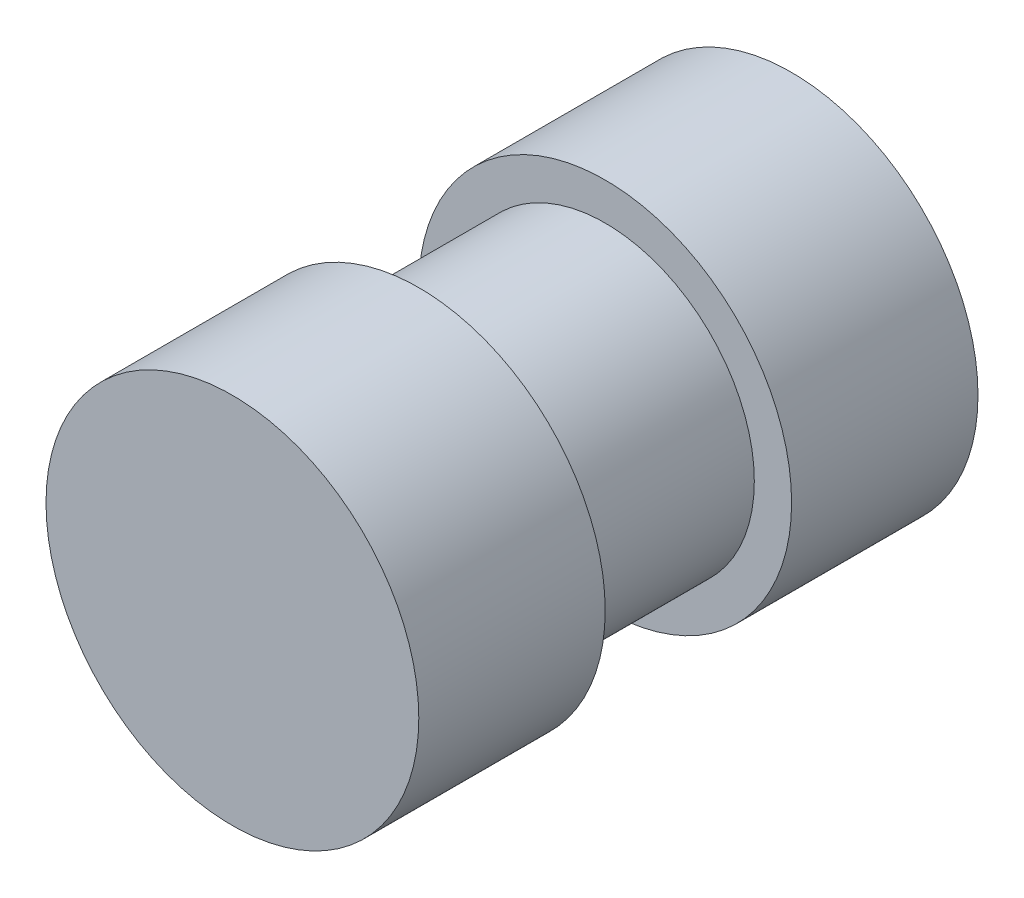
ISO-10303-21;
HEADER;
FILE_DESCRIPTION(('STEP AP214'),'2;1');
FILE_NAME('part.step','',(''),(''),'','','');
FILE_SCHEMA(('AUTOMOTIVE_DESIGN { 1 0 10303 214 1 1 1 1 }'));
ENDSEC;
DATA;
#1=APPLICATION_CONTEXT('core data for automotive mechanical design processes');
#2=APPLICATION_PROTOCOL_DEFINITION('international standard','automotive_design',2000,#1);
#3=PRODUCT_CONTEXT('',#1,'mechanical');
#4=PRODUCT('Part','Part','',(#3));
#5=PRODUCT_RELATED_PRODUCT_CATEGORY('part','',(#4));
#6=PRODUCT_DEFINITION_FORMATION('','',#4);
#7=PRODUCT_DEFINITION_CONTEXT('part definition',#1,'design');
#8=PRODUCT_DEFINITION('design','',#6,#7);
#9=PRODUCT_DEFINITION_SHAPE('','',#8);
#10=(LENGTH_UNIT() NAMED_UNIT(*) SI_UNIT(.MILLI.,.METRE.));
#11=(NAMED_UNIT(*) PLANE_ANGLE_UNIT() SI_UNIT($,.RADIAN.));
#12=(NAMED_UNIT(*) SI_UNIT($,.STERADIAN.) SOLID_ANGLE_UNIT());
#13=UNCERTAINTY_MEASURE_WITH_UNIT(LENGTH_MEASURE(1.E-05),#10,'distance_accuracy_value','');
#14=(GEOMETRIC_REPRESENTATION_CONTEXT(3) GLOBAL_UNCERTAINTY_ASSIGNED_CONTEXT((#13)) GLOBAL_UNIT_ASSIGNED_CONTEXT((#10,
#11,#12)) REPRESENTATION_CONTEXT('',''));
#15=CARTESIAN_POINT('',(0.,0.,0.));
#16=DIRECTION('',(0.,0.,1.));
#17=DIRECTION('',(1.,0.,0.));
#18=AXIS2_PLACEMENT_3D('',#15,#16,#17);
#19=CARTESIAN_POINT('',(0.,0.,7.5));
#20=DIRECTION('',(0.,0.,-1.));
#21=DIRECTION('',(-1.,0.,0.));
#22=AXIS2_PLACEMENT_3D('',#19,#20,#21);
#23=CYLINDRICAL_SURFACE('',#22,4.);
#24=CARTESIAN_POINT('',(0.,0.,2.5));
#25=DIRECTION('',(0.,0.,1.));
#26=DIRECTION('',(1.,0.,0.));
#27=AXIS2_PLACEMENT_3D('',#24,#25,#26);
#28=CIRCLE('',#27,4.);
#29=CARTESIAN_POINT('',(4.,0.,2.5));
#30=VERTEX_POINT('',#29);
#31=EDGE_CURVE('E37',#30,#30,#28,.T.);
#32=ORIENTED_EDGE('',*,*,#31,.F.);
#33=EDGE_LOOP('',(#32));
#34=FACE_BOUND('',#33,.T.);
#35=CARTESIAN_POINT('',(0.,0.,-2.5));
#36=DIRECTION('',(0.,0.,-1.));
#37=DIRECTION('',(-1.,0.,0.));
#38=AXIS2_PLACEMENT_3D('',#35,#36,#37);
#39=CIRCLE('',#38,4.);
#40=CARTESIAN_POINT('',(-4.,0.,-2.5));
#41=VERTEX_POINT('',#40);
#42=EDGE_CURVE('E10',#41,#41,#39,.T.);
#43=ORIENTED_EDGE('',*,*,#42,.F.);
#44=EDGE_LOOP('',(#43));
#45=FACE_BOUND('',#44,.T.);
#46=ADVANCED_FACE('F31',(#34,#45),#23,.T.);
#47=CARTESIAN_POINT('',(0.,0.,2.5));
#48=DIRECTION('',(0.,0.,1.));
#49=DIRECTION('',(1.,0.,0.));
#50=AXIS2_PLACEMENT_3D('',#47,#48,#49);
#51=CYLINDRICAL_SURFACE('',#50,5.);
#52=CARTESIAN_POINT('',(0.,0.,2.5));
#53=DIRECTION('',(0.,0.,1.));
#54=DIRECTION('',(1.,0.,0.));
#55=AXIS2_PLACEMENT_3D('',#52,#53,#54);
#56=CIRCLE('',#55,5.);
#57=CARTESIAN_POINT('',(5.,0.,2.5));
#58=VERTEX_POINT('',#57);
#59=EDGE_CURVE('E41',#58,#58,#56,.T.);
#60=ORIENTED_EDGE('',*,*,#59,.T.);
#61=EDGE_LOOP('',(#60));
#62=FACE_BOUND('',#61,.T.);
#63=CARTESIAN_POINT('',(0.,0.,7.5));
#64=DIRECTION('',(0.,0.,1.));
#65=DIRECTION('',(1.,0.,0.));
#66=AXIS2_PLACEMENT_3D('',#63,#64,#65);
#67=CIRCLE('',#66,5.);
#68=CARTESIAN_POINT('',(5.,0.,7.5));
#69=VERTEX_POINT('',#68);
#70=EDGE_CURVE('E45',#69,#69,#67,.T.);
#71=ORIENTED_EDGE('',*,*,#70,.F.);
#72=EDGE_LOOP('',(#71));
#73=FACE_BOUND('',#72,.T.);
#74=ADVANCED_FACE('F74',(#62,#73),#51,.T.);
#75=CARTESIAN_POINT('',(0.,0.,2.5));
#76=DIRECTION('',(0.,0.,1.));
#77=DIRECTION('',(1.,0.,0.));
#78=AXIS2_PLACEMENT_3D('',#75,#76,#77);
#79=PLANE('',#78);
#80=ORIENTED_EDGE('',*,*,#31,.T.);
#81=EDGE_LOOP('',(#80));
#82=FACE_BOUND('',#81,.T.);
#83=ORIENTED_EDGE('',*,*,#59,.F.);
#84=EDGE_LOOP('',(#83));
#85=FACE_BOUND('',#84,.T.);
#86=ADVANCED_FACE('F79',(#82,#85),#79,.F.);
#87=CARTESIAN_POINT('',(0.,0.,7.5));
#88=DIRECTION('',(0.,0.,1.));
#89=DIRECTION('',(1.,0.,0.));
#90=AXIS2_PLACEMENT_3D('',#87,#88,#89);
#91=PLANE('',#90);
#92=ORIENTED_EDGE('',*,*,#70,.T.);
#93=EDGE_LOOP('',(#92));
#94=FACE_BOUND('',#93,.T.);
#95=ADVANCED_FACE('F62',(#94),#91,.T.);
#96=CARTESIAN_POINT('',(0.,0.,-2.5));
#97=DIRECTION('',(0.,0.,-1.));
#98=DIRECTION('',(-1.,0.,0.));
#99=AXIS2_PLACEMENT_3D('',#96,#97,#98);
#100=CYLINDRICAL_SURFACE('',#99,5.);
#101=CARTESIAN_POINT('',(0.,0.,-2.5));
#102=DIRECTION('',(0.,0.,1.));
#103=DIRECTION('',(1.,0.,0.));
#104=AXIS2_PLACEMENT_3D('',#101,#102,#103);
#105=CIRCLE('',#104,5.);
#106=CARTESIAN_POINT('',(5.,0.,-2.5));
#107=VERTEX_POINT('',#106);
#108=EDGE_CURVE('E49',#107,#107,#105,.T.);
#109=ORIENTED_EDGE('',*,*,#108,.F.);
#110=EDGE_LOOP('',(#109));
#111=FACE_BOUND('',#110,.T.);
#112=CARTESIAN_POINT('',(0.,0.,-7.5));
#113=DIRECTION('',(0.,0.,1.));
#114=DIRECTION('',(1.,0.,0.));
#115=AXIS2_PLACEMENT_3D('',#112,#113,#114);
#116=CIRCLE('',#115,5.);
#117=CARTESIAN_POINT('',(5.,0.,-7.5));
#118=VERTEX_POINT('',#117);
#119=EDGE_CURVE('E51',#118,#118,#116,.T.);
#120=ORIENTED_EDGE('',*,*,#119,.T.);
#121=EDGE_LOOP('',(#120));
#122=FACE_BOUND('',#121,.T.);
#123=ADVANCED_FACE('F59',(#111,#122),#100,.T.);
#124=CARTESIAN_POINT('',(0.,0.,-2.5));
#125=DIRECTION('',(0.,0.,-1.));
#126=DIRECTION('',(1.,0.,0.));
#127=AXIS2_PLACEMENT_3D('',#124,#125,#126);
#128=PLANE('',#127);
#129=ORIENTED_EDGE('',*,*,#42,.T.);
#130=EDGE_LOOP('',(#129));
#131=FACE_BOUND('',#130,.T.);
#132=ORIENTED_EDGE('',*,*,#108,.T.);
#133=EDGE_LOOP('',(#132));
#134=FACE_BOUND('',#133,.T.);
#135=ADVANCED_FACE('F57',(#131,#134),#128,.F.);
#136=CARTESIAN_POINT('',(0.,0.,-7.5));
#137=DIRECTION('',(0.,0.,1.));
#138=DIRECTION('',(1.,0.,0.));
#139=AXIS2_PLACEMENT_3D('',#136,#137,#138);
#140=PLANE('',#139);
#141=ORIENTED_EDGE('',*,*,#119,.F.);
#142=EDGE_LOOP('',(#141));
#143=FACE_BOUND('',#142,.T.);
#144=ADVANCED_FACE('F66',(#143),#140,.F.);
#145=CLOSED_SHELL('',(#46,#74,#86,#95,#123,#135,#144));
#146=MANIFOLD_SOLID_BREP('B2',#145);
#147=ADVANCED_BREP_SHAPE_REPRESENTATION('',(#18,#146),#14);
#148=SHAPE_DEFINITION_REPRESENTATION(#9,#147);
ENDSEC;
END-ISO-10303-21;
